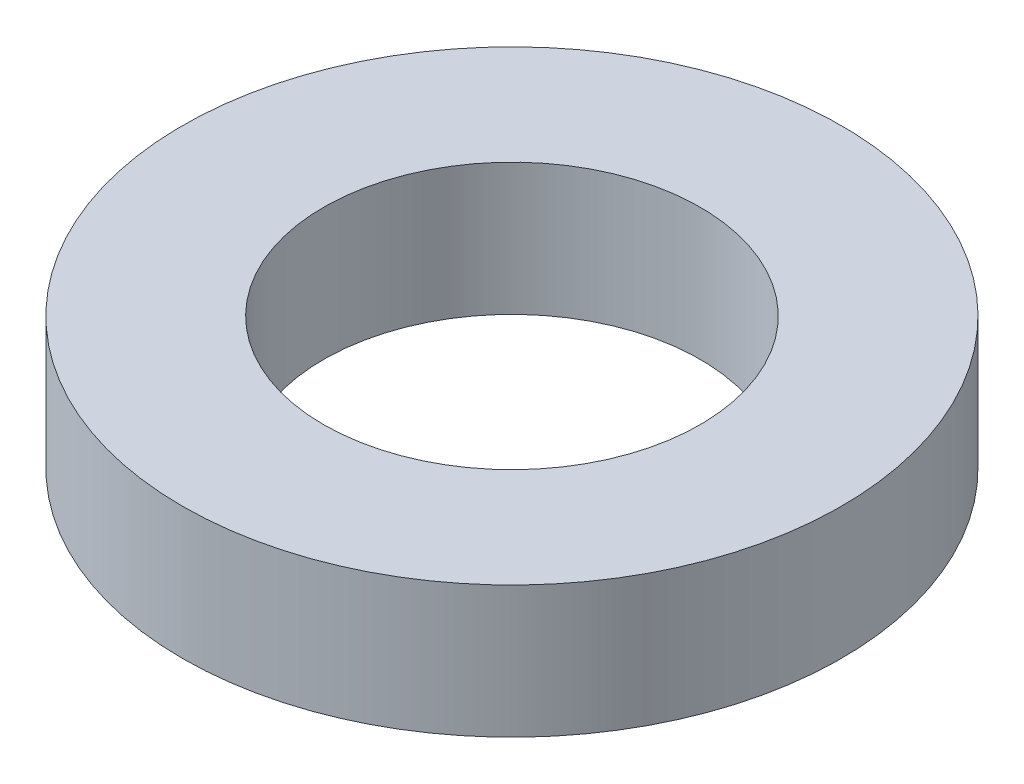
ISO-10303-21;
HEADER;
FILE_DESCRIPTION(('STEP AP214'),'2;1');
FILE_NAME('part.step','',(''),(''),'','','');
FILE_SCHEMA(('AUTOMOTIVE_DESIGN { 1 0 10303 214 1 1 1 1 }'));
ENDSEC;
DATA;
#1=APPLICATION_CONTEXT('core data for automotive mechanical design processes');
#2=APPLICATION_PROTOCOL_DEFINITION('international standard','automotive_design',2000,#1);
#3=PRODUCT_CONTEXT('',#1,'mechanical');
#4=PRODUCT('Part','Part','',(#3));
#5=PRODUCT_RELATED_PRODUCT_CATEGORY('part','',(#4));
#6=PRODUCT_DEFINITION_FORMATION('','',#4);
#7=PRODUCT_DEFINITION_CONTEXT('part definition',#1,'design');
#8=PRODUCT_DEFINITION('design','',#6,#7);
#9=PRODUCT_DEFINITION_SHAPE('','',#8);
#10=(LENGTH_UNIT() NAMED_UNIT(*) SI_UNIT(.MILLI.,.METRE.));
#11=(NAMED_UNIT(*) PLANE_ANGLE_UNIT() SI_UNIT($,.RADIAN.));
#12=(NAMED_UNIT(*) SI_UNIT($,.STERADIAN.) SOLID_ANGLE_UNIT());
#13=UNCERTAINTY_MEASURE_WITH_UNIT(LENGTH_MEASURE(1.E-05),#10,'distance_accuracy_value','');
#14=(GEOMETRIC_REPRESENTATION_CONTEXT(3) GLOBAL_UNCERTAINTY_ASSIGNED_CONTEXT((#13)) GLOBAL_UNIT_ASSIGNED_CONTEXT((#10,
#11,#12)) REPRESENTATION_CONTEXT('',''));
#15=CARTESIAN_POINT('',(0.,0.,0.));
#16=DIRECTION('',(0.,0.,1.));
#17=DIRECTION('',(1.,0.,0.));
#18=AXIS2_PLACEMENT_3D('',#15,#16,#17);
#19=CARTESIAN_POINT('',(0.,14.,0.));
#20=DIRECTION('',(0.,-1.,0.));
#21=DIRECTION('',(0.,0.,-1.));
#22=AXIS2_PLACEMENT_3D('',#19,#20,#21);
#23=CYLINDRICAL_SURFACE('',#22,35.);
#24=CARTESIAN_POINT('',(0.,14.,0.));
#25=DIRECTION('',(0.,1.,0.));
#26=DIRECTION('',(0.,0.,1.));
#27=AXIS2_PLACEMENT_3D('',#24,#25,#26);
#28=CIRCLE('',#27,35.);
#29=CARTESIAN_POINT('',(0.,14.,35.));
#30=VERTEX_POINT('',#29);
#31=EDGE_CURVE('E10',#30,#30,#28,.T.);
#32=ORIENTED_EDGE('',*,*,#31,.F.);
#33=EDGE_LOOP('',(#32));
#34=FACE_BOUND('',#33,.T.);
#35=CARTESIAN_POINT('',(0.,0.,0.));
#36=DIRECTION('',(0.,1.,0.));
#37=DIRECTION('',(0.,0.,1.));
#38=AXIS2_PLACEMENT_3D('',#35,#36,#37);
#39=CIRCLE('',#38,35.);
#40=CARTESIAN_POINT('',(0.,0.,35.));
#41=VERTEX_POINT('',#40);
#42=EDGE_CURVE('E37',#41,#41,#39,.T.);
#43=ORIENTED_EDGE('',*,*,#42,.T.);
#44=EDGE_LOOP('',(#43));
#45=FACE_BOUND('',#44,.T.);
#46=ADVANCED_FACE('F40',(#34,#45),#23,.T.);
#47=CARTESIAN_POINT('',(0.,14.,0.));
#48=DIRECTION('',(0.,1.,0.));
#49=DIRECTION('',(0.,0.,1.));
#50=AXIS2_PLACEMENT_3D('',#47,#48,#49);
#51=PLANE('',#50);
#52=CARTESIAN_POINT('',(0.,14.,0.));
#53=DIRECTION('',(0.,1.,0.));
#54=DIRECTION('',(0.,0.,1.));
#55=AXIS2_PLACEMENT_3D('',#52,#53,#54);
#56=CIRCLE('',#55,20.);
#57=CARTESIAN_POINT('',(0.,14.,20.));
#58=VERTEX_POINT('',#57);
#59=EDGE_CURVE('E50',#58,#58,#56,.T.);
#60=ORIENTED_EDGE('',*,*,#59,.F.);
#61=EDGE_LOOP('',(#60));
#62=FACE_BOUND('',#61,.T.);
#63=ORIENTED_EDGE('',*,*,#31,.T.);
#64=EDGE_LOOP('',(#63));
#65=FACE_BOUND('',#64,.T.);
#66=ADVANCED_FACE('F59',(#62,#65),#51,.T.);
#67=CARTESIAN_POINT('',(0.,0.,0.));
#68=DIRECTION('',(0.,1.,0.));
#69=DIRECTION('',(0.,0.,1.));
#70=AXIS2_PLACEMENT_3D('',#67,#68,#69);
#71=PLANE('',#70);
#72=CARTESIAN_POINT('',(0.,0.,0.));
#73=DIRECTION('',(0.,1.,0.));
#74=DIRECTION('',(0.,0.,1.));
#75=AXIS2_PLACEMENT_3D('',#72,#73,#74);
#76=CIRCLE('',#75,20.);
#77=CARTESIAN_POINT('',(0.,0.,20.));
#78=VERTEX_POINT('',#77);
#79=EDGE_CURVE('E47',#78,#78,#76,.T.);
#80=ORIENTED_EDGE('',*,*,#79,.T.);
#81=EDGE_LOOP('',(#80));
#82=FACE_BOUND('',#81,.T.);
#83=ORIENTED_EDGE('',*,*,#42,.F.);
#84=EDGE_LOOP('',(#83));
#85=FACE_BOUND('',#84,.T.);
#86=ADVANCED_FACE('F58',(#82,#85),#71,.F.);
#87=CARTESIAN_POINT('',(0.,14.,0.));
#88=DIRECTION('',(0.,-1.,0.));
#89=DIRECTION('',(0.,0.,-1.));
#90=AXIS2_PLACEMENT_3D('',#87,#88,#89);
#91=CYLINDRICAL_SURFACE('',#90,20.);
#92=ORIENTED_EDGE('',*,*,#59,.T.);
#93=EDGE_LOOP('',(#92));
#94=FACE_BOUND('',#93,.T.);
#95=ORIENTED_EDGE('',*,*,#79,.F.);
#96=EDGE_LOOP('',(#95));
#97=FACE_BOUND('',#96,.T.);
#98=ADVANCED_FACE('F54',(#94,#97),#91,.F.);
#99=CLOSED_SHELL('',(#46,#66,#86,#98));
#100=MANIFOLD_SOLID_BREP('B2',#99);
#101=ADVANCED_BREP_SHAPE_REPRESENTATION('',(#18,#100),#14);
#102=SHAPE_DEFINITION_REPRESENTATION(#9,#101);
ENDSEC;
END-ISO-10303-21;
